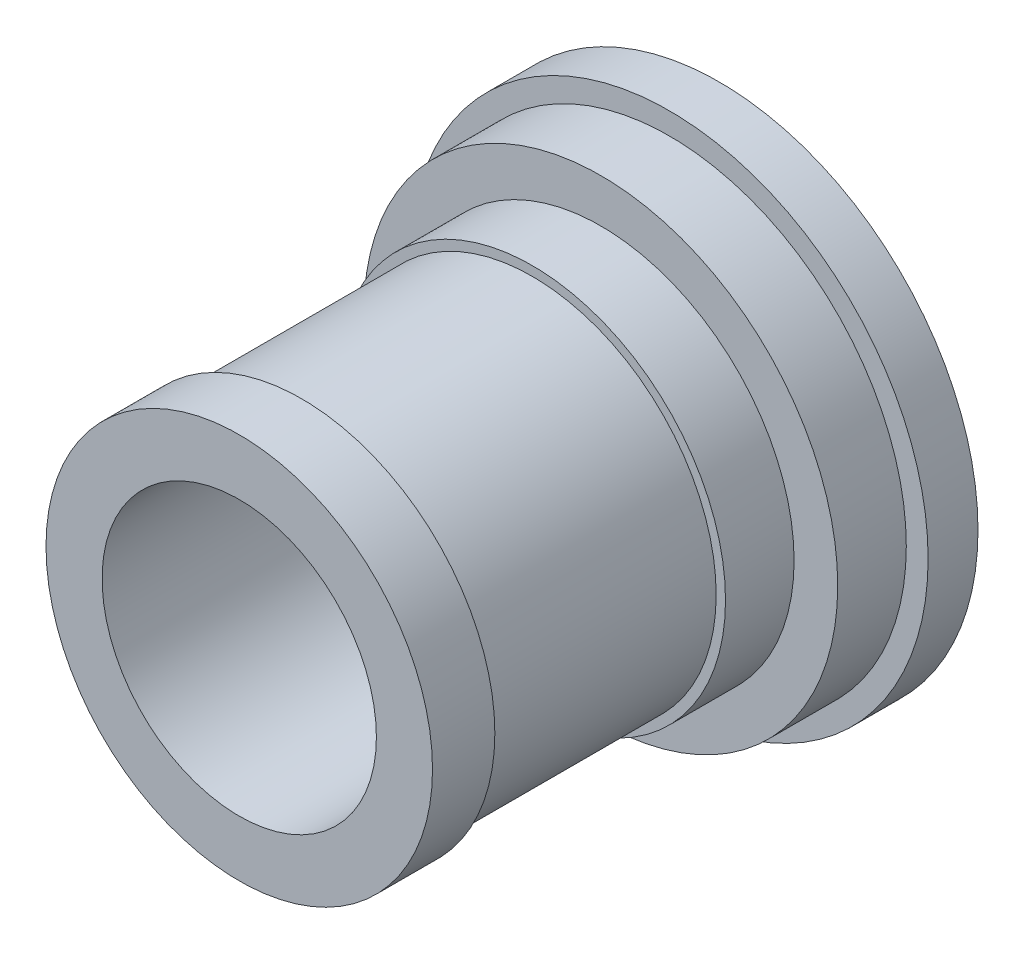
ISO-10303-21;
HEADER;
FILE_DESCRIPTION(('STEP AP214'),'2;1');
FILE_NAME('part.step','',(''),(''),'','','');
FILE_SCHEMA(('AUTOMOTIVE_DESIGN { 1 0 10303 214 1 1 1 1 }'));
ENDSEC;
DATA;
#1=APPLICATION_CONTEXT('core data for automotive mechanical design processes');
#2=APPLICATION_PROTOCOL_DEFINITION('international standard','automotive_design',2000,#1);
#3=PRODUCT_CONTEXT('',#1,'mechanical');
#4=PRODUCT('Part','Part','',(#3));
#5=PRODUCT_RELATED_PRODUCT_CATEGORY('part','',(#4));
#6=PRODUCT_DEFINITION_FORMATION('','',#4);
#7=PRODUCT_DEFINITION_CONTEXT('part definition',#1,'design');
#8=PRODUCT_DEFINITION('design','',#6,#7);
#9=PRODUCT_DEFINITION_SHAPE('','',#8);
#10=(LENGTH_UNIT() NAMED_UNIT(*) SI_UNIT(.MILLI.,.METRE.));
#11=(NAMED_UNIT(*) PLANE_ANGLE_UNIT() SI_UNIT($,.RADIAN.));
#12=(NAMED_UNIT(*) SI_UNIT($,.STERADIAN.) SOLID_ANGLE_UNIT());
#13=UNCERTAINTY_MEASURE_WITH_UNIT(LENGTH_MEASURE(1.E-05),#10,'distance_accuracy_value','');
#14=(GEOMETRIC_REPRESENTATION_CONTEXT(3) GLOBAL_UNCERTAINTY_ASSIGNED_CONTEXT((#13)) GLOBAL_UNIT_ASSIGNED_CONTEXT((#10,
#11,#12)) REPRESENTATION_CONTEXT('',''));
#15=CARTESIAN_POINT('',(0.,0.,0.));
#16=DIRECTION('',(0.,0.,1.));
#17=DIRECTION('',(1.,0.,0.));
#18=AXIS2_PLACEMENT_3D('',#15,#16,#17);
#19=CARTESIAN_POINT('',(0.,0.,0.));
#20=DIRECTION('',(0.,0.,1.));
#21=DIRECTION('',(1.,0.,0.));
#22=AXIS2_PLACEMENT_3D('',#19,#20,#21);
#23=CYLINDRICAL_SURFACE('',#22,22.);
#24=CARTESIAN_POINT('',(0.,0.,0.));
#25=DIRECTION('',(0.,0.,1.));
#26=DIRECTION('',(1.,0.,0.));
#27=AXIS2_PLACEMENT_3D('',#24,#25,#26);
#28=CIRCLE('',#27,22.);
#29=CARTESIAN_POINT('',(22.,0.,0.));
#30=VERTEX_POINT('',#29);
#31=EDGE_CURVE('E10',#30,#30,#28,.T.);
#32=ORIENTED_EDGE('',*,*,#31,.T.);
#33=EDGE_LOOP('',(#32));
#34=FACE_BOUND('',#33,.T.);
#35=CARTESIAN_POINT('',(0.,0.,-77.));
#36=DIRECTION('',(0.,0.,1.));
#37=DIRECTION('',(1.,0.,0.));
#38=AXIS2_PLACEMENT_3D('',#35,#36,#37);
#39=CIRCLE('',#38,22.);
#40=CARTESIAN_POINT('',(22.,0.,-77.));
#41=VERTEX_POINT('',#40);
#42=EDGE_CURVE('E70',#41,#41,#39,.T.);
#43=ORIENTED_EDGE('',*,*,#42,.F.);
#44=EDGE_LOOP('',(#43));
#45=FACE_BOUND('',#44,.T.);
#46=ADVANCED_FACE('F30',(#34,#45),#23,.F.);
#47=CARTESIAN_POINT('',(22.,0.,0.));
#48=DIRECTION('',(0.,0.,1.));
#49=DIRECTION('',(1.,0.,0.));
#50=AXIS2_PLACEMENT_3D('',#47,#48,#49);
#51=PLANE('',#50);
#52=CARTESIAN_POINT('',(0.,0.,0.));
#53=DIRECTION('',(0.,0.,1.));
#54=DIRECTION('',(1.,0.,0.));
#55=AXIS2_PLACEMENT_3D('',#52,#53,#54);
#56=CIRCLE('',#55,31.);
#57=CARTESIAN_POINT('',(31.,0.,0.));
#58=VERTEX_POINT('',#57);
#59=EDGE_CURVE('E36',#58,#58,#56,.T.);
#60=ORIENTED_EDGE('',*,*,#59,.T.);
#61=EDGE_LOOP('',(#60));
#62=FACE_BOUND('',#61,.T.);
#63=ORIENTED_EDGE('',*,*,#31,.F.);
#64=EDGE_LOOP('',(#63));
#65=FACE_BOUND('',#64,.T.);
#66=ADVANCED_FACE('F78',(#62,#65),#51,.T.);
#67=CARTESIAN_POINT('',(0.,0.,0.));
#68=DIRECTION('',(0.,0.,1.));
#69=DIRECTION('',(1.,0.,0.));
#70=AXIS2_PLACEMENT_3D('',#67,#68,#69);
#71=CYLINDRICAL_SURFACE('',#70,31.);
#72=CARTESIAN_POINT('',(0.,0.,-10.));
#73=DIRECTION('',(0.,0.,1.));
#74=DIRECTION('',(1.,0.,0.));
#75=AXIS2_PLACEMENT_3D('',#72,#73,#74);
#76=CIRCLE('',#75,31.);
#77=CARTESIAN_POINT('',(31.,0.,-10.));
#78=VERTEX_POINT('',#77);
#79=EDGE_CURVE('E40',#78,#78,#76,.T.);
#80=ORIENTED_EDGE('',*,*,#79,.T.);
#81=EDGE_LOOP('',(#80));
#82=FACE_BOUND('',#81,.T.);
#83=ORIENTED_EDGE('',*,*,#59,.F.);
#84=EDGE_LOOP('',(#83));
#85=FACE_BOUND('',#84,.T.);
#86=ADVANCED_FACE('F82',(#82,#85),#71,.T.);
#87=CARTESIAN_POINT('',(29.5,0.,-10.));
#88=DIRECTION('',(0.,0.,-1.));
#89=DIRECTION('',(-1.,0.,0.));
#90=AXIS2_PLACEMENT_3D('',#87,#88,#89);
#91=PLANE('',#90);
#92=CARTESIAN_POINT('',(0.,0.,-10.));
#93=DIRECTION('',(0.,0.,1.));
#94=DIRECTION('',(1.,0.,0.));
#95=AXIS2_PLACEMENT_3D('',#92,#93,#94);
#96=CIRCLE('',#95,29.5);
#97=CARTESIAN_POINT('',(29.5,0.,-10.));
#98=VERTEX_POINT('',#97);
#99=EDGE_CURVE('E44',#98,#98,#96,.T.);
#100=ORIENTED_EDGE('',*,*,#99,.T.);
#101=EDGE_LOOP('',(#100));
#102=FACE_BOUND('',#101,.T.);
#103=ORIENTED_EDGE('',*,*,#79,.F.);
#104=EDGE_LOOP('',(#103));
#105=FACE_BOUND('',#104,.T.);
#106=ADVANCED_FACE('F86',(#102,#105),#91,.T.);
#107=CARTESIAN_POINT('',(0.,0.,0.));
#108=DIRECTION('',(0.,0.,1.));
#109=DIRECTION('',(1.,0.,0.));
#110=AXIS2_PLACEMENT_3D('',#107,#108,#109);
#111=CYLINDRICAL_SURFACE('',#110,29.5);
#112=CARTESIAN_POINT('',(0.,0.,-47.));
#113=DIRECTION('',(0.,0.,1.));
#114=DIRECTION('',(1.,0.,0.));
#115=AXIS2_PLACEMENT_3D('',#112,#113,#114);
#116=CIRCLE('',#115,29.5);
#117=CARTESIAN_POINT('',(29.5,0.,-47.));
#118=VERTEX_POINT('',#117);
#119=EDGE_CURVE('E49',#118,#118,#116,.T.);
#120=ORIENTED_EDGE('',*,*,#119,.T.);
#121=EDGE_LOOP('',(#120));
#122=FACE_BOUND('',#121,.T.);
#123=ORIENTED_EDGE('',*,*,#99,.F.);
#124=EDGE_LOOP('',(#123));
#125=FACE_BOUND('',#124,.T.);
#126=ADVANCED_FACE('F93',(#122,#125),#111,.T.);
#127=CARTESIAN_POINT('',(31.,0.,-47.));
#128=DIRECTION('',(0.,0.,1.));
#129=DIRECTION('',(1.,0.,0.));
#130=AXIS2_PLACEMENT_3D('',#127,#128,#129);
#131=PLANE('',#130);
#132=CARTESIAN_POINT('',(0.,0.,-47.));
#133=DIRECTION('',(0.,0.,1.));
#134=DIRECTION('',(1.,0.,0.));
#135=AXIS2_PLACEMENT_3D('',#132,#133,#134);
#136=CIRCLE('',#135,31.);
#137=CARTESIAN_POINT('',(31.,0.,-47.));
#138=VERTEX_POINT('',#137);
#139=EDGE_CURVE('E52',#138,#138,#136,.T.);
#140=ORIENTED_EDGE('',*,*,#139,.T.);
#141=EDGE_LOOP('',(#140));
#142=FACE_BOUND('',#141,.T.);
#143=ORIENTED_EDGE('',*,*,#119,.F.);
#144=EDGE_LOOP('',(#143));
#145=FACE_BOUND('',#144,.T.);
#146=ADVANCED_FACE('F97',(#142,#145),#131,.T.);
#147=CARTESIAN_POINT('',(0.,0.,0.));
#148=DIRECTION('',(0.,0.,1.));
#149=DIRECTION('',(1.,0.,0.));
#150=AXIS2_PLACEMENT_3D('',#147,#148,#149);
#151=CYLINDRICAL_SURFACE('',#150,31.);
#152=CARTESIAN_POINT('',(0.,0.,-58.));
#153=DIRECTION('',(0.,0.,1.));
#154=DIRECTION('',(1.,0.,0.));
#155=AXIS2_PLACEMENT_3D('',#152,#153,#154);
#156=CIRCLE('',#155,31.);
#157=CARTESIAN_POINT('',(31.,0.,-58.));
#158=VERTEX_POINT('',#157);
#159=EDGE_CURVE('E55',#158,#158,#156,.T.);
#160=ORIENTED_EDGE('',*,*,#159,.T.);
#161=EDGE_LOOP('',(#160));
#162=FACE_BOUND('',#161,.T.);
#163=ORIENTED_EDGE('',*,*,#139,.F.);
#164=EDGE_LOOP('',(#163));
#165=FACE_BOUND('',#164,.T.);
#166=ADVANCED_FACE('F101',(#162,#165),#151,.T.);
#167=CARTESIAN_POINT('',(31.,0.,-58.));
#168=DIRECTION('',(0.,0.,1.));
#169=DIRECTION('',(1.,0.,0.));
#170=AXIS2_PLACEMENT_3D('',#167,#168,#169);
#171=PLANE('',#170);
#172=CARTESIAN_POINT('',(0.,0.,-58.));
#173=DIRECTION('',(0.,0.,1.));
#174=DIRECTION('',(1.,0.,0.));
#175=AXIS2_PLACEMENT_3D('',#172,#173,#174);
#176=CIRCLE('',#175,38.);
#177=CARTESIAN_POINT('',(38.,0.,-58.));
#178=VERTEX_POINT('',#177);
#179=EDGE_CURVE('E58',#178,#178,#176,.T.);
#180=ORIENTED_EDGE('',*,*,#179,.T.);
#181=EDGE_LOOP('',(#180));
#182=FACE_BOUND('',#181,.T.);
#183=ORIENTED_EDGE('',*,*,#159,.F.);
#184=EDGE_LOOP('',(#183));
#185=FACE_BOUND('',#184,.T.);
#186=ADVANCED_FACE('F105',(#182,#185),#171,.T.);
#187=CARTESIAN_POINT('',(0.,0.,0.));
#188=DIRECTION('',(0.,0.,1.));
#189=DIRECTION('',(1.,0.,0.));
#190=AXIS2_PLACEMENT_3D('',#187,#188,#189);
#191=CYLINDRICAL_SURFACE('',#190,38.);
#192=CARTESIAN_POINT('',(0.,0.,-69.));
#193=DIRECTION('',(0.,0.,1.));
#194=DIRECTION('',(1.,0.,0.));
#195=AXIS2_PLACEMENT_3D('',#192,#193,#194);
#196=CIRCLE('',#195,38.);
#197=CARTESIAN_POINT('',(38.,0.,-69.));
#198=VERTEX_POINT('',#197);
#199=EDGE_CURVE('E61',#198,#198,#196,.T.);
#200=ORIENTED_EDGE('',*,*,#199,.T.);
#201=EDGE_LOOP('',(#200));
#202=FACE_BOUND('',#201,.T.);
#203=ORIENTED_EDGE('',*,*,#179,.F.);
#204=EDGE_LOOP('',(#203));
#205=FACE_BOUND('',#204,.T.);
#206=ADVANCED_FACE('F109',(#202,#205),#191,.T.);
#207=CARTESIAN_POINT('',(38.,0.,-69.));
#208=DIRECTION('',(0.,0.,1.));
#209=DIRECTION('',(1.,0.,0.));
#210=AXIS2_PLACEMENT_3D('',#207,#208,#209);
#211=PLANE('',#210);
#212=CARTESIAN_POINT('',(0.,0.,-69.));
#213=DIRECTION('',(0.,0.,1.));
#214=DIRECTION('',(1.,0.,0.));
#215=AXIS2_PLACEMENT_3D('',#212,#213,#214);
#216=CIRCLE('',#215,41.5);
#217=CARTESIAN_POINT('',(41.5,0.,-69.));
#218=VERTEX_POINT('',#217);
#219=EDGE_CURVE('E64',#218,#218,#216,.T.);
#220=ORIENTED_EDGE('',*,*,#219,.T.);
#221=EDGE_LOOP('',(#220));
#222=FACE_BOUND('',#221,.T.);
#223=ORIENTED_EDGE('',*,*,#199,.F.);
#224=EDGE_LOOP('',(#223));
#225=FACE_BOUND('',#224,.T.);
#226=ADVANCED_FACE('F113',(#222,#225),#211,.T.);
#227=CARTESIAN_POINT('',(0.,0.,0.));
#228=DIRECTION('',(0.,0.,1.));
#229=DIRECTION('',(1.,0.,0.));
#230=AXIS2_PLACEMENT_3D('',#227,#228,#229);
#231=CYLINDRICAL_SURFACE('',#230,41.5);
#232=CARTESIAN_POINT('',(0.,0.,-77.));
#233=DIRECTION('',(0.,0.,1.));
#234=DIRECTION('',(1.,0.,0.));
#235=AXIS2_PLACEMENT_3D('',#232,#233,#234);
#236=CIRCLE('',#235,41.5);
#237=CARTESIAN_POINT('',(41.5,0.,-77.));
#238=VERTEX_POINT('',#237);
#239=EDGE_CURVE('E67',#238,#238,#236,.T.);
#240=ORIENTED_EDGE('',*,*,#239,.T.);
#241=EDGE_LOOP('',(#240));
#242=FACE_BOUND('',#241,.T.);
#243=ORIENTED_EDGE('',*,*,#219,.F.);
#244=EDGE_LOOP('',(#243));
#245=FACE_BOUND('',#244,.T.);
#246=ADVANCED_FACE('F117',(#242,#245),#231,.T.);
#247=CARTESIAN_POINT('',(41.5,0.,-77.));
#248=DIRECTION('',(0.,0.,-1.));
#249=DIRECTION('',(-1.,0.,0.));
#250=AXIS2_PLACEMENT_3D('',#247,#248,#249);
#251=PLANE('',#250);
#252=ORIENTED_EDGE('',*,*,#42,.T.);
#253=EDGE_LOOP('',(#252));
#254=FACE_BOUND('',#253,.T.);
#255=ORIENTED_EDGE('',*,*,#239,.F.);
#256=EDGE_LOOP('',(#255));
#257=FACE_BOUND('',#256,.T.);
#258=ADVANCED_FACE('F74',(#254,#257),#251,.T.);
#259=CLOSED_SHELL('',(#46,#66,#86,#106,#126,#146,#166,#186,#206,#226,#246,#258));
#260=MANIFOLD_SOLID_BREP('B2',#259);
#261=ADVANCED_BREP_SHAPE_REPRESENTATION('',(#18,#260),#14);
#262=SHAPE_DEFINITION_REPRESENTATION(#9,#261);
ENDSEC;
END-ISO-10303-21;
